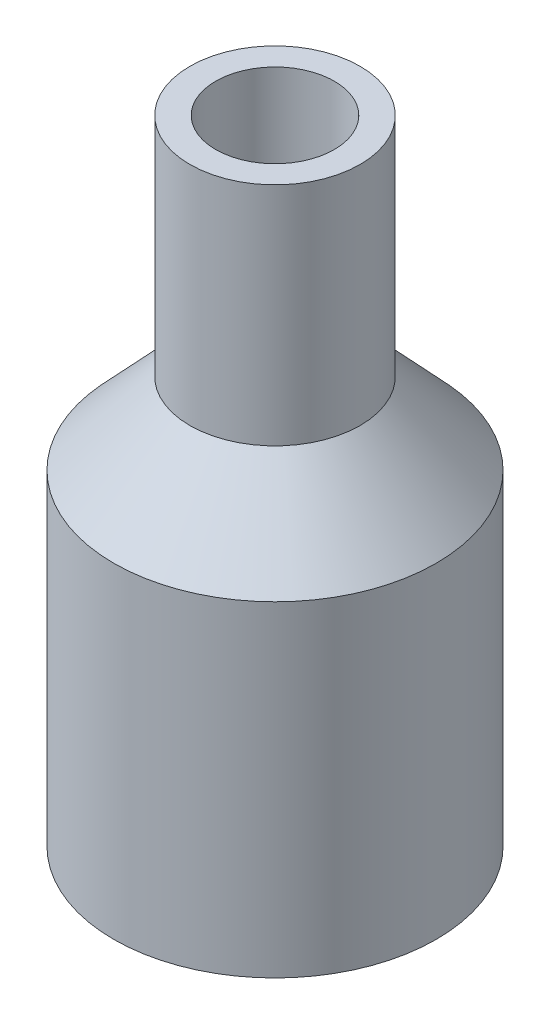
ISO-10303-21;
HEADER;
FILE_DESCRIPTION(('STEP AP214'),'2;1');
FILE_NAME('part.step','',(''),(''),'','','');
FILE_SCHEMA(('AUTOMOTIVE_DESIGN { 1 0 10303 214 1 1 1 1 }'));
ENDSEC;
DATA;
#1=APPLICATION_CONTEXT('core data for automotive mechanical design processes');
#2=APPLICATION_PROTOCOL_DEFINITION('international standard','automotive_design',2000,#1);
#3=PRODUCT_CONTEXT('',#1,'mechanical');
#4=PRODUCT('Part','Part','',(#3));
#5=PRODUCT_RELATED_PRODUCT_CATEGORY('part','',(#4));
#6=PRODUCT_DEFINITION_FORMATION('','',#4);
#7=PRODUCT_DEFINITION_CONTEXT('part definition',#1,'design');
#8=PRODUCT_DEFINITION('design','',#6,#7);
#9=PRODUCT_DEFINITION_SHAPE('','',#8);
#10=(LENGTH_UNIT() NAMED_UNIT(*) SI_UNIT(.MILLI.,.METRE.));
#11=(NAMED_UNIT(*) PLANE_ANGLE_UNIT() SI_UNIT($,.RADIAN.));
#12=(NAMED_UNIT(*) SI_UNIT($,.STERADIAN.) SOLID_ANGLE_UNIT());
#13=UNCERTAINTY_MEASURE_WITH_UNIT(LENGTH_MEASURE(1.E-05),#10,'distance_accuracy_value','');
#14=(GEOMETRIC_REPRESENTATION_CONTEXT(3) GLOBAL_UNCERTAINTY_ASSIGNED_CONTEXT((#13)) GLOBAL_UNIT_ASSIGNED_CONTEXT((#10,
#11,#12)) REPRESENTATION_CONTEXT('',''));
#15=CARTESIAN_POINT('',(0.,0.,0.));
#16=DIRECTION('',(0.,0.,1.));
#17=DIRECTION('',(1.,0.,0.));
#18=AXIS2_PLACEMENT_3D('',#15,#16,#17);
#19=CARTESIAN_POINT('',(3.71789915705332,0.,0.));
#20=DIRECTION('',(0.,1.,0.));
#21=DIRECTION('',(0.,0.,1.));
#22=AXIS2_PLACEMENT_3D('',#19,#20,#21);
#23=PLANE('',#22);
#24=CARTESIAN_POINT('',(26.3895027409974,0.,0.));
#25=DIRECTION('',(0.,1.,0.));
#26=DIRECTION('',(0.,0.,1.));
#27=AXIS2_PLACEMENT_3D('',#24,#25,#26);
#28=CIRCLE('',#27,26.3895027409974);
#29=CARTESIAN_POINT('',(26.3895027409974,0.,26.3895027409974));
#30=VERTEX_POINT('',#29);
#31=EDGE_CURVE('E10',#30,#30,#28,.T.);
#32=ORIENTED_EDGE('',*,*,#31,.F.);
#33=EDGE_LOOP('',(#32));
#34=FACE_BOUND('',#33,.T.);
#35=CARTESIAN_POINT('',(26.3895027409974,0.,0.));
#36=DIRECTION('',(0.,1.,0.));
#37=DIRECTION('',(0.,0.,1.));
#38=AXIS2_PLACEMENT_3D('',#35,#36,#37);
#39=CIRCLE('',#38,22.6716035839441);
#40=CARTESIAN_POINT('',(26.3895027409974,0.,22.6716035839441));
#41=VERTEX_POINT('',#40);
#42=EDGE_CURVE('E59',#41,#41,#39,.T.);
#43=ORIENTED_EDGE('',*,*,#42,.T.);
#44=EDGE_LOOP('',(#43));
#45=FACE_BOUND('',#44,.T.);
#46=ADVANCED_FACE('F31',(#34,#45),#23,.F.);
#47=CARTESIAN_POINT('',(26.3895027409974,105.802883707485,0.));
#48=DIRECTION('',(0.,1.,0.));
#49=DIRECTION('',(0.,0.,1.));
#50=AXIS2_PLACEMENT_3D('',#47,#48,#49);
#51=CYLINDRICAL_SURFACE('',#50,26.3895027409974);
#52=CARTESIAN_POINT('',(26.3895027409974,53.3160377358491,0.));
#53=DIRECTION('',(0.,1.,0.));
#54=DIRECTION('',(0.,0.,1.));
#55=AXIS2_PLACEMENT_3D('',#52,#53,#54);
#56=CIRCLE('',#55,26.3895027409974);
#57=CARTESIAN_POINT('',(26.3895027409974,53.3160377358491,26.3895027409974));
#58=VERTEX_POINT('',#57);
#59=EDGE_CURVE('E37',#58,#58,#56,.T.);
#60=ORIENTED_EDGE('',*,*,#59,.F.);
#61=EDGE_LOOP('',(#60));
#62=FACE_BOUND('',#61,.T.);
#63=ORIENTED_EDGE('',*,*,#31,.T.);
#64=EDGE_LOOP('',(#63));
#65=FACE_BOUND('',#64,.T.);
#66=ADVANCED_FACE('F96',(#62,#65),#51,.T.);
#67=CARTESIAN_POINT('',(26.3895027409974,53.3160377358491,0.));
#68=DIRECTION('',(0.,-1.,0.));
#69=DIRECTION('',(0.,0.,-1.));
#70=AXIS2_PLACEMENT_3D('',#67,#68,#69);
#71=CONICAL_SURFACE('',#70,26.3895027409974,0.75371979553654);
#72=CARTESIAN_POINT('',(26.3895027409974,66.5946346386562,0.));
#73=DIRECTION('',(0.,1.,0.));
#74=DIRECTION('',(0.,0.,1.));
#75=AXIS2_PLACEMENT_3D('',#72,#73,#74);
#76=CIRCLE('',#75,13.9266265734024);
#77=CARTESIAN_POINT('',(26.3895027409974,66.5946346386562,13.9266265734024));
#78=VERTEX_POINT('',#77);
#79=EDGE_CURVE('E41',#78,#78,#76,.T.);
#80=ORIENTED_EDGE('',*,*,#79,.F.);
#81=EDGE_LOOP('',(#80));
#82=FACE_BOUND('',#81,.T.);
#83=ORIENTED_EDGE('',*,*,#59,.T.);
#84=EDGE_LOOP('',(#83));
#85=FACE_BOUND('',#84,.T.);
#86=ADVANCED_FACE('F91',(#82,#85),#71,.T.);
#87=CARTESIAN_POINT('',(26.3895027409974,105.802883707485,0.));
#88=DIRECTION('',(0.,1.,0.));
#89=DIRECTION('',(0.,0.,1.));
#90=AXIS2_PLACEMENT_3D('',#87,#88,#89);
#91=CYLINDRICAL_SURFACE('',#90,13.9266265734024);
#92=CARTESIAN_POINT('',(26.3895027409974,103.597786517886,0.));
#93=DIRECTION('',(0.,1.,0.));
#94=DIRECTION('',(0.,0.,1.));
#95=AXIS2_PLACEMENT_3D('',#92,#93,#94);
#96=CIRCLE('',#95,13.9266265734024);
#97=CARTESIAN_POINT('',(26.3895027409974,103.597786517886,13.9266265734024));
#98=VERTEX_POINT('',#97);
#99=EDGE_CURVE('E45',#98,#98,#96,.T.);
#100=ORIENTED_EDGE('',*,*,#99,.F.);
#101=EDGE_LOOP('',(#100));
#102=FACE_BOUND('',#101,.T.);
#103=ORIENTED_EDGE('',*,*,#79,.T.);
#104=EDGE_LOOP('',(#103));
#105=FACE_BOUND('',#104,.T.);
#106=ADVANCED_FACE('F85',(#102,#105),#91,.T.);
#107=CARTESIAN_POINT('',(12.4628761675951,103.597786517886,0.));
#108=DIRECTION('',(0.,-1.,0.));
#109=DIRECTION('',(0.,0.,-1.));
#110=AXIS2_PLACEMENT_3D('',#107,#108,#109);
#111=PLANE('',#110);
#112=CARTESIAN_POINT('',(26.3895027409974,103.597786517886,0.));
#113=DIRECTION('',(0.,1.,0.));
#114=DIRECTION('',(0.,0.,1.));
#115=AXIS2_PLACEMENT_3D('',#112,#113,#114);
#116=CIRCLE('',#115,9.70242763423916);
#117=CARTESIAN_POINT('',(26.3895027409974,103.597786517886,9.70242763423916));
#118=VERTEX_POINT('',#117);
#119=EDGE_CURVE('E50',#118,#118,#116,.T.);
#120=ORIENTED_EDGE('',*,*,#119,.F.);
#121=EDGE_LOOP('',(#120));
#122=FACE_BOUND('',#121,.T.);
#123=ORIENTED_EDGE('',*,*,#99,.T.);
#124=EDGE_LOOP('',(#123));
#125=FACE_BOUND('',#124,.T.);
#126=ADVANCED_FACE('F79',(#122,#125),#111,.F.);
#127=CARTESIAN_POINT('',(26.3895027409974,105.802883707485,0.));
#128=DIRECTION('',(0.,1.,0.));
#129=DIRECTION('',(0.,0.,1.));
#130=AXIS2_PLACEMENT_3D('',#127,#128,#129);
#131=CYLINDRICAL_SURFACE('',#130,9.70242763423916);
#132=CARTESIAN_POINT('',(26.3895027409974,65.8173976532792,0.));
#133=DIRECTION('',(0.,1.,0.));
#134=DIRECTION('',(0.,0.,1.));
#135=AXIS2_PLACEMENT_3D('',#132,#133,#134);
#136=CIRCLE('',#135,9.70242763423915);
#137=CARTESIAN_POINT('',(26.3895027409974,65.8173976532792,9.70242763423915));
#138=VERTEX_POINT('',#137);
#139=EDGE_CURVE('E53',#138,#138,#136,.T.);
#140=ORIENTED_EDGE('',*,*,#139,.F.);
#141=EDGE_LOOP('',(#140));
#142=FACE_BOUND('',#141,.T.);
#143=ORIENTED_EDGE('',*,*,#119,.T.);
#144=EDGE_LOOP('',(#143));
#145=FACE_BOUND('',#144,.T.);
#146=ADVANCED_FACE('F73',(#142,#145),#131,.F.);
#147=CARTESIAN_POINT('',(26.3895027409974,65.8173976532792,0.));
#148=DIRECTION('',(0.,-1.,0.));
#149=DIRECTION('',(0.,0.,-1.));
#150=AXIS2_PLACEMENT_3D('',#147,#148,#149);
#151=CONICAL_SURFACE('',#150,9.70242763423915,0.75371979553654);
#152=CARTESIAN_POINT('',(26.3895027409974,51.9993626120994,0.));
#153=DIRECTION('',(0.,1.,0.));
#154=DIRECTION('',(0.,0.,1.));
#155=AXIS2_PLACEMENT_3D('',#152,#153,#154);
#156=CIRCLE('',#155,22.6716035839441);
#157=CARTESIAN_POINT('',(26.3895027409974,51.9993626120994,22.6716035839441));
#158=VERTEX_POINT('',#157);
#159=EDGE_CURVE('E56',#158,#158,#156,.T.);
#160=ORIENTED_EDGE('',*,*,#159,.F.);
#161=EDGE_LOOP('',(#160));
#162=FACE_BOUND('',#161,.T.);
#163=ORIENTED_EDGE('',*,*,#139,.T.);
#164=EDGE_LOOP('',(#163));
#165=FACE_BOUND('',#164,.T.);
#166=ADVANCED_FACE('F67',(#162,#165),#151,.F.);
#167=CARTESIAN_POINT('',(26.3895027409974,105.802883707485,0.));
#168=DIRECTION('',(0.,1.,0.));
#169=DIRECTION('',(0.,0.,1.));
#170=AXIS2_PLACEMENT_3D('',#167,#168,#169);
#171=CYLINDRICAL_SURFACE('',#170,22.6716035839441);
#172=ORIENTED_EDGE('',*,*,#42,.F.);
#173=EDGE_LOOP('',(#172));
#174=FACE_BOUND('',#173,.T.);
#175=ORIENTED_EDGE('',*,*,#159,.T.);
#176=EDGE_LOOP('',(#175));
#177=FACE_BOUND('',#176,.T.);
#178=ADVANCED_FACE('F64',(#174,#177),#171,.F.);
#179=CLOSED_SHELL('',(#46,#66,#86,#106,#126,#146,#166,#178));
#180=MANIFOLD_SOLID_BREP('B2',#179);
#181=ADVANCED_BREP_SHAPE_REPRESENTATION('',(#18,#180),#14);
#182=SHAPE_DEFINITION_REPRESENTATION(#9,#181);
ENDSEC;
END-ISO-10303-21;
